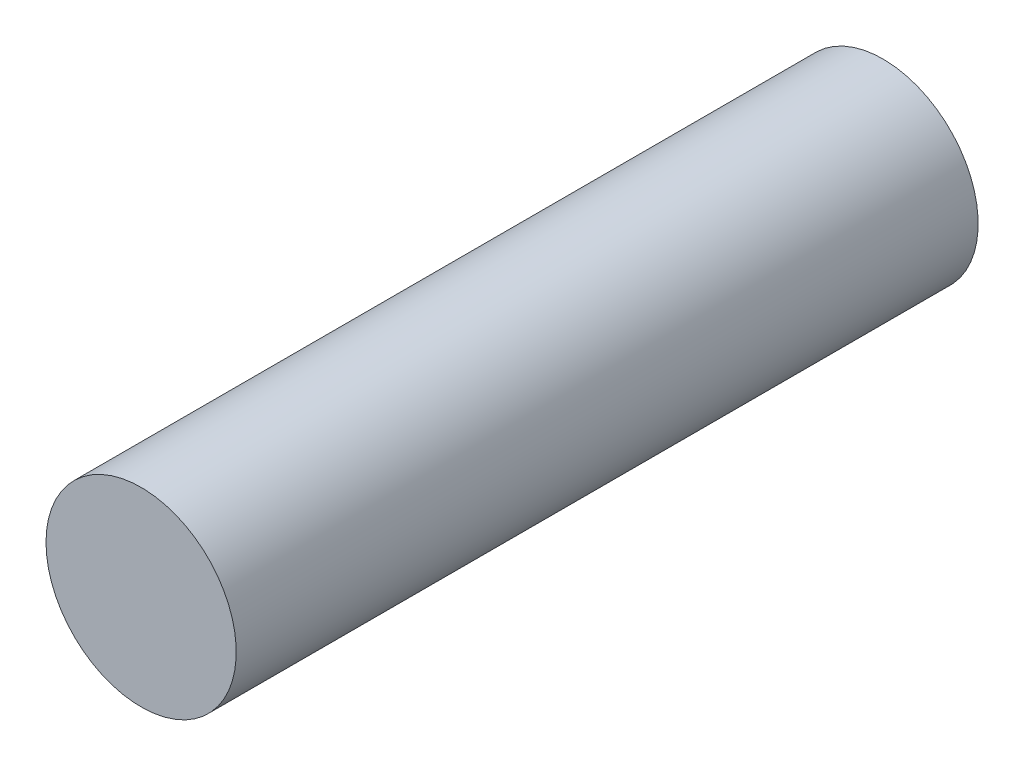
ISO-10303-21;
HEADER;
FILE_DESCRIPTION(('STEP AP214'),'2;1');
FILE_NAME('part.step','',(''),(''),'','','');
FILE_SCHEMA(('AUTOMOTIVE_DESIGN { 1 0 10303 214 1 1 1 1 }'));
ENDSEC;
DATA;
#1=APPLICATION_CONTEXT('core data for automotive mechanical design processes');
#2=APPLICATION_PROTOCOL_DEFINITION('international standard','automotive_design',2000,#1);
#3=PRODUCT_CONTEXT('',#1,'mechanical');
#4=PRODUCT('Part','Part','',(#3));
#5=PRODUCT_RELATED_PRODUCT_CATEGORY('part','',(#4));
#6=PRODUCT_DEFINITION_FORMATION('','',#4);
#7=PRODUCT_DEFINITION_CONTEXT('part definition',#1,'design');
#8=PRODUCT_DEFINITION('design','',#6,#7);
#9=PRODUCT_DEFINITION_SHAPE('','',#8);
#10=(LENGTH_UNIT() NAMED_UNIT(*) SI_UNIT(.MILLI.,.METRE.));
#11=(NAMED_UNIT(*) PLANE_ANGLE_UNIT() SI_UNIT($,.RADIAN.));
#12=(NAMED_UNIT(*) SI_UNIT($,.STERADIAN.) SOLID_ANGLE_UNIT());
#13=UNCERTAINTY_MEASURE_WITH_UNIT(LENGTH_MEASURE(1.E-05),#10,'distance_accuracy_value','');
#14=(GEOMETRIC_REPRESENTATION_CONTEXT(3) GLOBAL_UNCERTAINTY_ASSIGNED_CONTEXT((#13)) GLOBAL_UNIT_ASSIGNED_CONTEXT((#10,
#11,#12)) REPRESENTATION_CONTEXT('',''));
#15=CARTESIAN_POINT('',(0.,0.,0.));
#16=DIRECTION('',(0.,0.,1.));
#17=DIRECTION('',(1.,0.,0.));
#18=AXIS2_PLACEMENT_3D('',#15,#16,#17);
#19=CARTESIAN_POINT('',(0.0499999,0.,0.38999922));
#20=DIRECTION('',(0.,0.,-1.));
#21=DIRECTION('',(0.,-1.,0.));
#22=AXIS2_PLACEMENT_3D('',#19,#20,#21);
#23=PLANE('',#22);
#24=CARTESIAN_POINT('',(0.,0.,0.38999922));
#25=DIRECTION('',(0.,0.,1.));
#26=DIRECTION('',(1.,0.,0.));
#27=AXIS2_PLACEMENT_3D('',#24,#25,#26);
#28=CIRCLE('',#27,0.0499999);
#29=CARTESIAN_POINT('',(-0.0499999,0.,0.38999922));
#30=VERTEX_POINT('',#29);
#31=EDGE_CURVE('E11',#30,#30,#28,.T.);
#32=ORIENTED_EDGE('',*,*,#31,.T.);
#33=EDGE_LOOP('',(#32));
#34=FACE_BOUND('',#33,.T.);
#35=ADVANCED_FACE('F17',(#34),#23,.F.);
#36=CARTESIAN_POINT('',(0.0499999,0.,0.));
#37=DIRECTION('',(0.,0.,-1.));
#38=DIRECTION('',(0.,-1.,0.));
#39=AXIS2_PLACEMENT_3D('',#36,#37,#38);
#40=PLANE('',#39);
#41=CARTESIAN_POINT('',(0.,0.,0.));
#42=DIRECTION('',(0.,0.,1.));
#43=DIRECTION('',(1.,0.,0.));
#44=AXIS2_PLACEMENT_3D('',#41,#42,#43);
#45=CIRCLE('',#44,0.0499999);
#46=CARTESIAN_POINT('',(-0.0499999,0.,0.));
#47=VERTEX_POINT('',#46);
#48=EDGE_CURVE('E20',#47,#47,#45,.T.);
#49=ORIENTED_EDGE('',*,*,#48,.F.);
#50=EDGE_LOOP('',(#49));
#51=FACE_BOUND('',#50,.T.);
#52=ADVANCED_FACE('F58',(#51),#40,.T.);
#53=CARTESIAN_POINT('',(0.,0.,0.));
#54=DIRECTION('',(0.,0.,-1.));
#55=DIRECTION('',(1.,0.,0.));
#56=AXIS2_PLACEMENT_3D('',#53,#54,#55);
#57=CYLINDRICAL_SURFACE('',#56,0.0499999);
#58=ORIENTED_EDGE('',*,*,#48,.T.);
#59=DIRECTION('',(0.,0.,1.));
#60=VECTOR('',#59,1.);
#61=CARTESIAN_POINT('',(-0.0499999,0.,0.));
#62=LINE('',#61,#60);
#63=EDGE_CURVE('E27',#47,#30,#62,.T.);
#64=ORIENTED_EDGE('',*,*,#63,.T.);
#65=ORIENTED_EDGE('',*,*,#31,.F.);
#66=ORIENTED_EDGE('',*,*,#63,.F.);
#67=EDGE_LOOP('',(#58,#64,#65,#66));
#68=FACE_BOUND('',#67,.T.);
#69=ADVANCED_FACE('F42',(#68),#57,.T.);
#70=CLOSED_SHELL('',(#35,#52,#69));
#71=MANIFOLD_SOLID_BREP('B1',#70);
#72=ADVANCED_BREP_SHAPE_REPRESENTATION('',(#18,#71),#14);
#73=SHAPE_DEFINITION_REPRESENTATION(#9,#72);
ENDSEC;
END-ISO-10303-21;
